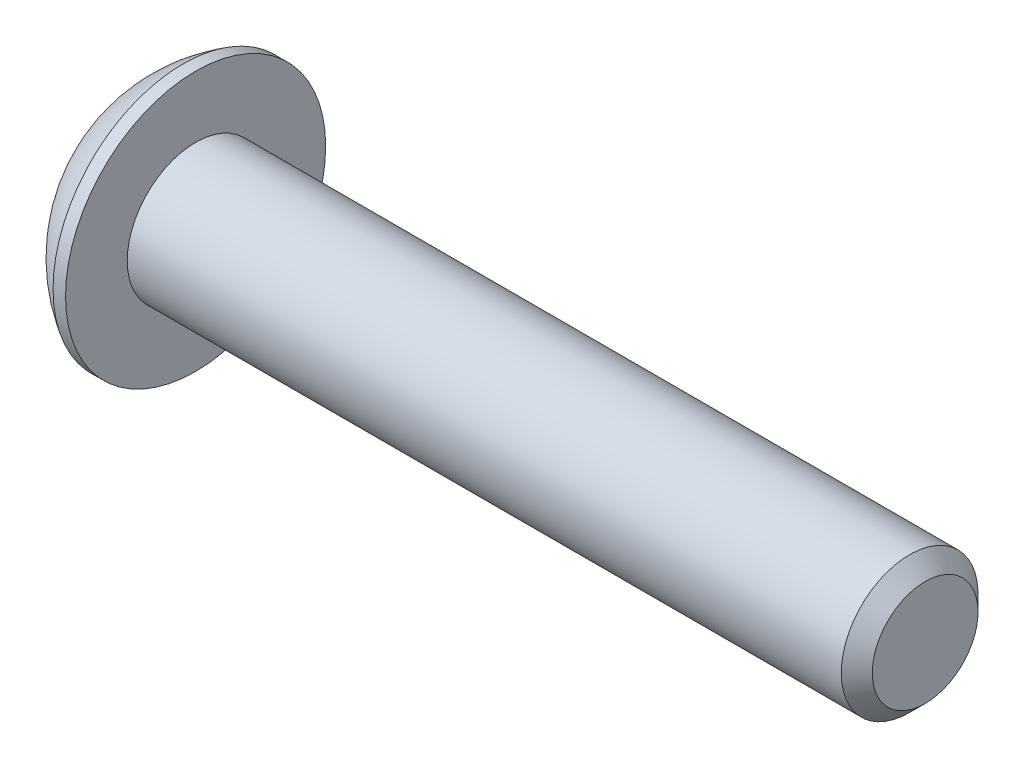
ISO-10303-21;
HEADER;
FILE_DESCRIPTION(('STEP AP214'),'2;1');
FILE_NAME('part.step','',(''),(''),'','','');
FILE_SCHEMA(('AUTOMOTIVE_DESIGN { 1 0 10303 214 1 1 1 1 }'));
ENDSEC;
DATA;
#1=APPLICATION_CONTEXT('core data for automotive mechanical design processes');
#2=APPLICATION_PROTOCOL_DEFINITION('international standard','automotive_design',2000,#1);
#3=PRODUCT_CONTEXT('',#1,'mechanical');
#4=PRODUCT('Part','Part','',(#3));
#5=PRODUCT_RELATED_PRODUCT_CATEGORY('part','',(#4));
#6=PRODUCT_DEFINITION_FORMATION('','',#4);
#7=PRODUCT_DEFINITION_CONTEXT('part definition',#1,'design');
#8=PRODUCT_DEFINITION('design','',#6,#7);
#9=PRODUCT_DEFINITION_SHAPE('','',#8);
#10=(LENGTH_UNIT() NAMED_UNIT(*) SI_UNIT(.MILLI.,.METRE.));
#11=(NAMED_UNIT(*) PLANE_ANGLE_UNIT() SI_UNIT($,.RADIAN.));
#12=(NAMED_UNIT(*) SI_UNIT($,.STERADIAN.) SOLID_ANGLE_UNIT());
#13=UNCERTAINTY_MEASURE_WITH_UNIT(LENGTH_MEASURE(1.E-05),#10,'distance_accuracy_value','');
#14=(GEOMETRIC_REPRESENTATION_CONTEXT(3) GLOBAL_UNCERTAINTY_ASSIGNED_CONTEXT((#13)) GLOBAL_UNIT_ASSIGNED_CONTEXT((#10,
#11,#12)) REPRESENTATION_CONTEXT('',''));
#15=CARTESIAN_POINT('',(0.,0.,0.));
#16=DIRECTION('',(0.,0.,1.));
#17=DIRECTION('',(1.,0.,0.));
#18=AXIS2_PLACEMENT_3D('',#15,#16,#17);
#19=CARTESIAN_POINT('',(1.32080000000034,0.,0.));
#20=DIRECTION('',(-1.,0.,0.));
#21=DIRECTION('',(0.,0.,1.));
#22=AXIS2_PLACEMENT_3D('',#19,#20,#21);
#23=CONICAL_SURFACE('',#22,1.1937999999998,1.04719755119608);
#24=CARTESIAN_POINT('',(2.01004075135902,0.,4.44089209850063E-13));
#25=VERTEX_POINT('',#24);
#26=VERTEX_LOOP('',#25);
#27=FACE_BOUND('',#26,.T.);
#28=CARTESIAN_POINT('',(1.32080000000009,0.,0.));
#29=DIRECTION('',(-1.,0.,0.));
#30=DIRECTION('',(0.,0.,1.));
#31=AXIS2_PLACEMENT_3D('',#28,#29,#30);
#32=CIRCLE('',#31,1.19380000000024);
#33=CARTESIAN_POINT('',(1.32080000000004,-1.03386112703797,0.59690000000006));
#34=VERTEX_POINT('',#33);
#35=CARTESIAN_POINT('',(1.32080000000004,0.,1.19380000000012));
#36=VERTEX_POINT('',#35);
#37=EDGE_CURVE('E19',#34,#36,#32,.T.);
#38=ORIENTED_EDGE('',*,*,#37,.T.);
#39=CARTESIAN_POINT('',(1.32080000000009,0.,0.));
#40=DIRECTION('',(-1.,0.,0.));
#41=DIRECTION('',(0.,0.,1.));
#42=AXIS2_PLACEMENT_3D('',#39,#40,#41);
#43=CIRCLE('',#42,1.19380000000024);
#44=CARTESIAN_POINT('',(1.32080000000004,1.03386112703797,0.596900000000061));
#45=VERTEX_POINT('',#44);
#46=EDGE_CURVE('E148',#36,#45,#43,.T.);
#47=ORIENTED_EDGE('',*,*,#46,.T.);
#48=CARTESIAN_POINT('',(1.32080000000009,0.,0.));
#49=DIRECTION('',(-1.,0.,0.));
#50=DIRECTION('',(0.,0.,1.));
#51=AXIS2_PLACEMENT_3D('',#48,#49,#50);
#52=CIRCLE('',#51,1.19380000000024);
#53=CARTESIAN_POINT('',(1.32080000000004,1.03386112703797,-0.596900000000061));
#54=VERTEX_POINT('',#53);
#55=EDGE_CURVE('E318',#45,#54,#52,.T.);
#56=ORIENTED_EDGE('',*,*,#55,.T.);
#57=CARTESIAN_POINT('',(1.32080000000009,0.,0.));
#58=DIRECTION('',(-1.,0.,0.));
#59=DIRECTION('',(0.,0.,1.));
#60=AXIS2_PLACEMENT_3D('',#57,#58,#59);
#61=CIRCLE('',#60,1.19380000000024);
#62=CARTESIAN_POINT('',(1.32080000000004,1.49457637585666E-12,-1.19380000000012));
#63=VERTEX_POINT('',#62);
#64=EDGE_CURVE('E319',#54,#63,#61,.T.);
#65=ORIENTED_EDGE('',*,*,#64,.T.);
#66=CARTESIAN_POINT('',(1.32080000000009,0.,0.));
#67=DIRECTION('',(-1.,0.,0.));
#68=DIRECTION('',(0.,0.,1.));
#69=AXIS2_PLACEMENT_3D('',#66,#67,#68);
#70=CIRCLE('',#69,1.19380000000024);
#71=CARTESIAN_POINT('',(1.32080000000004,-1.03386112703797,-0.59690000000006));
#72=VERTEX_POINT('',#71);
#73=EDGE_CURVE('E92',#63,#72,#70,.T.);
#74=ORIENTED_EDGE('',*,*,#73,.T.);
#75=CARTESIAN_POINT('',(1.32080000000009,0.,0.));
#76=DIRECTION('',(-1.,0.,0.));
#77=DIRECTION('',(0.,0.,1.));
#78=AXIS2_PLACEMENT_3D('',#75,#76,#77);
#79=CIRCLE('',#78,1.19380000000024);
#80=EDGE_CURVE('E88',#72,#34,#79,.T.);
#81=ORIENTED_EDGE('',*,*,#80,.T.);
#82=EDGE_LOOP('',(#38,#47,#56,#65,#74,#81));
#83=FACE_BOUND('',#82,.T.);
#84=ADVANCED_FACE('F16',(#27,#83),#23,.F.);
#85=CARTESIAN_POINT('',(1.3208,-2.06772225407572,-1.1938));
#86=DIRECTION('',(1.,0.,0.));
#87=DIRECTION('',(0.,0.,-1.));
#88=AXIS2_PLACEMENT_3D('',#85,#86,#87);
#89=PLANE('',#88);
#90=DIRECTION('',(0.,0.5,0.866025403784439));
#91=VECTOR('',#90,1.);
#92=CARTESIAN_POINT('',(1.3208,-1.37848150271715,0.));
#93=LINE('',#92,#91);
#94=CARTESIAN_POINT('',(1.3208,-0.689240751358574,1.1938));
#95=VERTEX_POINT('',#94);
#96=EDGE_CURVE('E100',#95,#34,#93,.F.);
#97=ORIENTED_EDGE('',*,*,#96,.F.);
#98=DIRECTION('',(0.,1.,0.));
#99=VECTOR('',#98,1.);
#100=CARTESIAN_POINT('',(1.3208,-0.689240751358574,1.1938));
#101=LINE('',#100,#99);
#102=EDGE_CURVE('E102',#36,#95,#101,.F.);
#103=ORIENTED_EDGE('',*,*,#102,.F.);
#104=ORIENTED_EDGE('',*,*,#37,.F.);
#105=EDGE_LOOP('',(#97,#103,#104));
#106=FACE_BOUND('',#105,.T.);
#107=ADVANCED_FACE('F98',(#106),#89,.F.);
#108=CARTESIAN_POINT('',(1.3208,-2.06772225407572,-1.1938));
#109=DIRECTION('',(1.,0.,0.));
#110=DIRECTION('',(0.,0.,-1.));
#111=AXIS2_PLACEMENT_3D('',#108,#109,#110);
#112=PLANE('',#111);
#113=DIRECTION('',(0.,-0.5,0.866025403784439));
#114=VECTOR('',#113,1.);
#115=CARTESIAN_POINT('',(1.3208,-0.689240751358574,-1.1938));
#116=LINE('',#115,#114);
#117=CARTESIAN_POINT('',(1.3208,-1.37848150271715,0.));
#118=VERTEX_POINT('',#117);
#119=EDGE_CURVE('E108',#118,#72,#116,.F.);
#120=ORIENTED_EDGE('',*,*,#119,.F.);
#121=DIRECTION('',(0.,0.5,0.866025403784439));
#122=VECTOR('',#121,1.);
#123=CARTESIAN_POINT('',(1.3208,-1.37848150271715,0.));
#124=LINE('',#123,#122);
#125=EDGE_CURVE('E105',#34,#118,#124,.F.);
#126=ORIENTED_EDGE('',*,*,#125,.F.);
#127=ORIENTED_EDGE('',*,*,#80,.F.);
#128=EDGE_LOOP('',(#120,#126,#127));
#129=FACE_BOUND('',#128,.T.);
#130=ADVANCED_FACE('F106',(#129),#112,.F.);
#131=CARTESIAN_POINT('',(1.3208,-2.06772225407572,-1.1938));
#132=DIRECTION('',(1.,0.,0.));
#133=DIRECTION('',(0.,0.,-1.));
#134=AXIS2_PLACEMENT_3D('',#131,#132,#133);
#135=PLANE('',#134);
#136=DIRECTION('',(0.,1.,0.));
#137=VECTOR('',#136,1.);
#138=CARTESIAN_POINT('',(1.3208,0.689240751358577,-1.1938));
#139=LINE('',#138,#137);
#140=CARTESIAN_POINT('',(1.3208,-0.689240751358574,-1.1938));
#141=VERTEX_POINT('',#140);
#142=EDGE_CURVE('E288',#141,#63,#139,.T.);
#143=ORIENTED_EDGE('',*,*,#142,.F.);
#144=DIRECTION('',(0.,-0.5,0.866025403784439));
#145=VECTOR('',#144,1.);
#146=CARTESIAN_POINT('',(1.3208,-0.689240751358574,-1.1938));
#147=LINE('',#146,#145);
#148=EDGE_CURVE('E300',#72,#141,#147,.F.);
#149=ORIENTED_EDGE('',*,*,#148,.F.);
#150=ORIENTED_EDGE('',*,*,#73,.F.);
#151=EDGE_LOOP('',(#143,#149,#150));
#152=FACE_BOUND('',#151,.T.);
#153=ADVANCED_FACE('F191',(#152),#135,.F.);
#154=CARTESIAN_POINT('',(1.3208,-2.06772225407572,-1.1938));
#155=DIRECTION('',(1.,0.,0.));
#156=DIRECTION('',(0.,0.,-1.));
#157=AXIS2_PLACEMENT_3D('',#154,#155,#156);
#158=PLANE('',#157);
#159=DIRECTION('',(0.,-0.5,-0.866025403784439));
#160=VECTOR('',#159,1.);
#161=CARTESIAN_POINT('',(1.3208,1.37848150271715,0.));
#162=LINE('',#161,#160);
#163=CARTESIAN_POINT('',(1.3208,0.689240751358577,-1.1938));
#164=VERTEX_POINT('',#163);
#165=EDGE_CURVE('E274',#164,#54,#162,.F.);
#166=ORIENTED_EDGE('',*,*,#165,.F.);
#167=DIRECTION('',(0.,1.,0.));
#168=VECTOR('',#167,1.);
#169=CARTESIAN_POINT('',(1.3208,0.689240751358577,-1.1938));
#170=LINE('',#169,#168);
#171=EDGE_CURVE('E285',#63,#164,#170,.T.);
#172=ORIENTED_EDGE('',*,*,#171,.F.);
#173=ORIENTED_EDGE('',*,*,#64,.F.);
#174=EDGE_LOOP('',(#166,#172,#173));
#175=FACE_BOUND('',#174,.T.);
#176=ADVANCED_FACE('F187',(#175),#158,.F.);
#177=CARTESIAN_POINT('',(1.3208,-2.06772225407572,-1.1938));
#178=DIRECTION('',(1.,0.,0.));
#179=DIRECTION('',(0.,0.,-1.));
#180=AXIS2_PLACEMENT_3D('',#177,#178,#179);
#181=PLANE('',#180);
#182=DIRECTION('',(0.,0.5,-0.866025403784439));
#183=VECTOR('',#182,1.);
#184=CARTESIAN_POINT('',(1.3208,0.689240751358576,1.1938));
#185=LINE('',#184,#183);
#186=CARTESIAN_POINT('',(1.3208,1.37848150271715,0.));
#187=VERTEX_POINT('',#186);
#188=EDGE_CURVE('E253',#187,#45,#185,.F.);
#189=ORIENTED_EDGE('',*,*,#188,.F.);
#190=DIRECTION('',(0.,-0.5,-0.866025403784439));
#191=VECTOR('',#190,1.);
#192=CARTESIAN_POINT('',(1.3208,1.37848150271715,0.));
#193=LINE('',#192,#191);
#194=EDGE_CURVE('E272',#54,#187,#193,.F.);
#195=ORIENTED_EDGE('',*,*,#194,.F.);
#196=ORIENTED_EDGE('',*,*,#55,.F.);
#197=EDGE_LOOP('',(#189,#195,#196));
#198=FACE_BOUND('',#197,.T.);
#199=ADVANCED_FACE('F183',(#198),#181,.F.);
#200=CARTESIAN_POINT('',(1.3208,-2.06772225407572,-1.1938));
#201=DIRECTION('',(1.,0.,0.));
#202=DIRECTION('',(0.,0.,-1.));
#203=AXIS2_PLACEMENT_3D('',#200,#201,#202);
#204=PLANE('',#203);
#205=DIRECTION('',(0.,1.,0.));
#206=VECTOR('',#205,1.);
#207=CARTESIAN_POINT('',(1.3208,-0.689240751358574,1.1938));
#208=LINE('',#207,#206);
#209=CARTESIAN_POINT('',(1.3208,0.689240751358576,1.1938));
#210=VERTEX_POINT('',#209);
#211=EDGE_CURVE('E117',#210,#36,#208,.F.);
#212=ORIENTED_EDGE('',*,*,#211,.F.);
#213=DIRECTION('',(0.,0.5,-0.866025403784439));
#214=VECTOR('',#213,1.);
#215=CARTESIAN_POINT('',(1.3208,0.689240751358576,1.1938));
#216=LINE('',#215,#214);
#217=EDGE_CURVE('E256',#45,#210,#216,.F.);
#218=ORIENTED_EDGE('',*,*,#217,.F.);
#219=ORIENTED_EDGE('',*,*,#46,.F.);
#220=EDGE_LOOP('',(#212,#218,#219));
#221=FACE_BOUND('',#220,.T.);
#222=ADVANCED_FACE('F179',(#221),#204,.F.);
#223=CARTESIAN_POINT('',(1.3208,-0.689240751358574,1.1938));
#224=DIRECTION('',(0.,0.,-1.));
#225=DIRECTION('',(0.,1.,0.));
#226=AXIS2_PLACEMENT_3D('',#223,#224,#225);
#227=PLANE('',#226);
#228=DIRECTION('',(0.,1.,0.));
#229=VECTOR('',#228,1.);
#230=CARTESIAN_POINT('',(0.,0.,1.1938));
#231=LINE('',#230,#229);
#232=CARTESIAN_POINT('',(0.,0.689240751358577,1.1938));
#233=VERTEX_POINT('',#232);
#234=CARTESIAN_POINT('',(0.,-0.689240751358574,1.1938));
#235=VERTEX_POINT('',#234);
#236=EDGE_CURVE('E250',#233,#235,#231,.F.);
#237=ORIENTED_EDGE('',*,*,#236,.F.);
#238=DIRECTION('',(1.,0.,0.));
#239=VECTOR('',#238,1.);
#240=CARTESIAN_POINT('',(1.3208,0.689240751358576,1.1938));
#241=LINE('',#240,#239);
#242=EDGE_CURVE('E262',#210,#233,#241,.F.);
#243=ORIENTED_EDGE('',*,*,#242,.F.);
#244=ORIENTED_EDGE('',*,*,#211,.T.);
#245=ORIENTED_EDGE('',*,*,#102,.T.);
#246=DIRECTION('',(1.,0.,0.));
#247=VECTOR('',#246,1.);
#248=CARTESIAN_POINT('',(1.3208,-0.689240751358574,1.1938));
#249=LINE('',#248,#247);
#250=EDGE_CURVE('E111',#235,#95,#249,.T.);
#251=ORIENTED_EDGE('',*,*,#250,.F.);
#252=EDGE_LOOP('',(#237,#243,#244,#245,#251));
#253=FACE_BOUND('',#252,.T.);
#254=ADVANCED_FACE('F176',(#253),#227,.T.);
#255=CARTESIAN_POINT('',(1.3208,-1.37848150271715,0.));
#256=DIRECTION('',(0.,0.866025403784439,-0.5));
#257=DIRECTION('',(0.,0.5,0.866025403784439));
#258=AXIS2_PLACEMENT_3D('',#255,#256,#257);
#259=PLANE('',#258);
#260=DIRECTION('',(0.,-0.5,-0.866025403784439));
#261=VECTOR('',#260,1.);
#262=CARTESIAN_POINT('',(0.,-0.689240751358574,1.1938));
#263=LINE('',#262,#261);
#264=CARTESIAN_POINT('',(0.,-1.37848150271715,0.));
#265=VERTEX_POINT('',#264);
#266=EDGE_CURVE('E247',#235,#265,#263,.T.);
#267=ORIENTED_EDGE('',*,*,#266,.F.);
#268=ORIENTED_EDGE('',*,*,#250,.T.);
#269=ORIENTED_EDGE('',*,*,#96,.T.);
#270=ORIENTED_EDGE('',*,*,#125,.T.);
#271=DIRECTION('',(1.,0.,0.));
#272=VECTOR('',#271,1.);
#273=CARTESIAN_POINT('',(1.3208,-1.37848150271715,0.));
#274=LINE('',#273,#272);
#275=EDGE_CURVE('E297',#265,#118,#274,.T.);
#276=ORIENTED_EDGE('',*,*,#275,.F.);
#277=EDGE_LOOP('',(#267,#268,#269,#270,#276));
#278=FACE_BOUND('',#277,.T.);
#279=ADVANCED_FACE('F115',(#278),#259,.T.);
#280=CARTESIAN_POINT('',(1.3208,-0.689240751358574,-1.1938));
#281=DIRECTION('',(0.,0.866025403784439,0.5));
#282=DIRECTION('',(0.,-0.5,0.866025403784439));
#283=AXIS2_PLACEMENT_3D('',#280,#281,#282);
#284=PLANE('',#283);
#285=DIRECTION('',(0.,0.5,-0.866025403784439));
#286=VECTOR('',#285,1.);
#287=CARTESIAN_POINT('',(0.,-1.37848150271715,0.));
#288=LINE('',#287,#286);
#289=CARTESIAN_POINT('',(0.,-0.689240751358574,-1.1938));
#290=VERTEX_POINT('',#289);
#291=EDGE_CURVE('E244',#265,#290,#288,.T.);
#292=ORIENTED_EDGE('',*,*,#291,.F.);
#293=ORIENTED_EDGE('',*,*,#275,.T.);
#294=ORIENTED_EDGE('',*,*,#119,.T.);
#295=ORIENTED_EDGE('',*,*,#148,.T.);
#296=DIRECTION('',(1.,0.,0.));
#297=VECTOR('',#296,1.);
#298=CARTESIAN_POINT('',(1.3208,-0.689240751358574,-1.1938));
#299=LINE('',#298,#297);
#300=EDGE_CURVE('E282',#290,#141,#299,.T.);
#301=ORIENTED_EDGE('',*,*,#300,.F.);
#302=EDGE_LOOP('',(#292,#293,#294,#295,#301));
#303=FACE_BOUND('',#302,.T.);
#304=ADVANCED_FACE('F169',(#303),#284,.T.);
#305=CARTESIAN_POINT('',(1.3208,0.689240751358577,-1.1938));
#306=DIRECTION('',(0.,0.,1.));
#307=DIRECTION('',(1.,0.,0.));
#308=AXIS2_PLACEMENT_3D('',#305,#306,#307);
#309=PLANE('',#308);
#310=DIRECTION('',(0.,1.,0.));
#311=VECTOR('',#310,1.);
#312=CARTESIAN_POINT('',(0.,0.,-1.1938));
#313=LINE('',#312,#311);
#314=CARTESIAN_POINT('',(0.,0.689240751358577,-1.1938));
#315=VERTEX_POINT('',#314);
#316=EDGE_CURVE('E241',#290,#315,#313,.T.);
#317=ORIENTED_EDGE('',*,*,#316,.F.);
#318=ORIENTED_EDGE('',*,*,#300,.T.);
#319=ORIENTED_EDGE('',*,*,#142,.T.);
#320=ORIENTED_EDGE('',*,*,#171,.T.);
#321=DIRECTION('',(1.,0.,0.));
#322=VECTOR('',#321,1.);
#323=CARTESIAN_POINT('',(1.3208,0.689240751358577,-1.1938));
#324=LINE('',#323,#322);
#325=EDGE_CURVE('E257',#315,#164,#324,.T.);
#326=ORIENTED_EDGE('',*,*,#325,.F.);
#327=EDGE_LOOP('',(#317,#318,#319,#320,#326));
#328=FACE_BOUND('',#327,.T.);
#329=ADVANCED_FACE('F166',(#328),#309,.T.);
#330=CARTESIAN_POINT('',(1.3208,1.37848150271715,0.));
#331=DIRECTION('',(0.,-0.866025403784439,0.5));
#332=DIRECTION('',(0.,-0.5,-0.866025403784439));
#333=AXIS2_PLACEMENT_3D('',#330,#331,#332);
#334=PLANE('',#333);
#335=DIRECTION('',(0.,0.5,0.866025403784439));
#336=VECTOR('',#335,1.);
#337=CARTESIAN_POINT('',(0.,0.689240751358577,-1.1938));
#338=LINE('',#337,#336);
#339=CARTESIAN_POINT('',(0.,1.37848150271715,0.));
#340=VERTEX_POINT('',#339);
#341=EDGE_CURVE('E238',#315,#340,#338,.T.);
#342=ORIENTED_EDGE('',*,*,#341,.F.);
#343=ORIENTED_EDGE('',*,*,#325,.T.);
#344=ORIENTED_EDGE('',*,*,#165,.T.);
#345=ORIENTED_EDGE('',*,*,#194,.T.);
#346=DIRECTION('',(1.,0.,0.));
#347=VECTOR('',#346,1.);
#348=CARTESIAN_POINT('',(1.3208,1.37848150271715,0.));
#349=LINE('',#348,#347);
#350=EDGE_CURVE('E34',#340,#187,#349,.T.);
#351=ORIENTED_EDGE('',*,*,#350,.F.);
#352=EDGE_LOOP('',(#342,#343,#344,#345,#351));
#353=FACE_BOUND('',#352,.T.);
#354=ADVANCED_FACE('F162',(#353),#334,.T.);
#355=CARTESIAN_POINT('',(1.3208,0.689240751358576,1.1938));
#356=DIRECTION('',(0.,-0.866025403784439,-0.5));
#357=DIRECTION('',(0.,0.5,-0.866025403784439));
#358=AXIS2_PLACEMENT_3D('',#355,#356,#357);
#359=PLANE('',#358);
#360=DIRECTION('',(0.,-0.5,0.866025403784439));
#361=VECTOR('',#360,1.);
#362=CARTESIAN_POINT('',(0.,1.37848150271715,0.));
#363=LINE('',#362,#361);
#364=EDGE_CURVE('E147',#340,#233,#363,.T.);
#365=ORIENTED_EDGE('',*,*,#364,.F.);
#366=ORIENTED_EDGE('',*,*,#350,.T.);
#367=ORIENTED_EDGE('',*,*,#188,.T.);
#368=ORIENTED_EDGE('',*,*,#217,.T.);
#369=ORIENTED_EDGE('',*,*,#242,.T.);
#370=EDGE_LOOP('',(#365,#366,#367,#368,#369));
#371=FACE_BOUND('',#370,.T.);
#372=ADVANCED_FACE('F158',(#371),#359,.T.);
#373=CARTESIAN_POINT('',(0.,0.,0.));
#374=DIRECTION('',(-1.,0.,0.));
#375=DIRECTION('',(0.,0.,1.));
#376=AXIS2_PLACEMENT_3D('',#373,#374,#375);
#377=PLANE('',#376);
#378=ORIENTED_EDGE('',*,*,#341,.T.);
#379=ORIENTED_EDGE('',*,*,#364,.T.);
#380=ORIENTED_EDGE('',*,*,#236,.T.);
#381=ORIENTED_EDGE('',*,*,#266,.T.);
#382=ORIENTED_EDGE('',*,*,#291,.T.);
#383=ORIENTED_EDGE('',*,*,#316,.T.);
#384=EDGE_LOOP('',(#378,#379,#380,#381,#382,#383));
#385=FACE_BOUND('',#384,.T.);
#386=CARTESIAN_POINT('',(0.,1.9812,0.));
#387=CARTESIAN_POINT('',(0.,1.9811996664299,0.0556258831179428));
#388=CARTESIAN_POINT('',(0.,1.97885520380442,0.111261989398606));
#389=CARTESIAN_POINT('',(0.,1.96949260169541,0.222149719830458));
#390=CARTESIAN_POINT('',(0.,1.96247308239605,0.277401225602895));
#391=CARTESIAN_POINT('',(0.,1.94379192841038,0.387209508139747));
#392=CARTESIAN_POINT('',(-1.85325793235264E-13,1.93212292489526,0.441765039546365));
#393=CARTESIAN_POINT('',(1.86344214223505E-13,1.90422331175315,0.549729449347493));
#394=CARTESIAN_POINT('',(6.94543371897454E-13,1.88798900035338,0.603137359208869));
#395=CARTESIAN_POINT('',(1.15501975216981E-12,1.83266214476501,0.760839131321828));
#396=CARTESIAN_POINT('',(0.,1.78690023648845,0.862876433575429));
#397=CARTESIAN_POINT('',(0.,1.67887358150667,1.05780719540872));
#398=CARTESIAN_POINT('',(9.54193214892627E-13,1.6166082074585,1.15070030720801));
#399=CARTESIAN_POINT('',(5.94805591894675E-13,1.51224157140982,1.28116890915697));
#400=CARTESIAN_POINT('',(1.63221293851378E-13,1.4755970394354,1.32320451127026));
#401=CARTESIAN_POINT('',(-1.62196980336157E-13,1.39893832619713,1.40400288695709));
#402=CARTESIAN_POINT('',(0.,1.35892742784698,1.44276877695455));
#403=CARTESIAN_POINT('',(1.14362537325405E-13,1.23416504602197,1.55382272417904));
#404=CARTESIAN_POINT('',(0.,1.14466125559859,1.62089527952111));
#405=CARTESIAN_POINT('',(0.,0.955712144178167,1.7390221808118));
#406=CARTESIAN_POINT('',(0.,0.856267198233564,1.79007713076007));
#407=CARTESIAN_POINT('',(0.,0.650206345910843,1.87477637530954));
#408=CARTESIAN_POINT('',(0.,0.543590516134855,1.90842085586267));
#409=CARTESIAN_POINT('',(0.,0.326226155292018,1.95733039300656));
#410=CARTESIAN_POINT('',(0.,0.21547760215793,1.97259535144288));
#411=CARTESIAN_POINT('',(0.,-0.00701040587544639,1.98431697865418));
#412=CARTESIAN_POINT('',(0.,-0.118749860774734,1.98077364742917));
#413=CARTESIAN_POINT('',(0.,-0.340050178355485,1.95497485623825));
#414=CARTESIAN_POINT('',(0.,-0.449611052668255,1.93271949620218));
#415=CARTESIAN_POINT('',(0.,-0.663431110729174,1.87014138774523));
#416=CARTESIAN_POINT('',(0.,-0.76769023783852,1.82981844635272));
#417=CARTESIAN_POINT('',(0.,-0.968005760719347,1.73219968377096));
#418=CARTESIAN_POINT('',(0.,-1.0640618469811,1.6749032225164));
#419=CARTESIAN_POINT('',(0.,-1.19980276751283,1.57757371205873));
#420=CARTESIAN_POINT('',(0.,-1.24366557129213,1.54322665019466));
#421=CARTESIAN_POINT('',(0.,-1.32838995706696,1.47093063174264));
#422=CARTESIAN_POINT('',(0.,-1.36924860178706,1.43297823102439));
#423=CARTESIAN_POINT('',(0.,-1.48674671849223,1.31419842051173));
#424=CARTESIAN_POINT('',(0.,-1.55842832343237,1.22836221289311));
#425=CARTESIAN_POINT('',(0.,-1.6863396856475,1.04586168272493));
#426=CARTESIAN_POINT('',(0.,-1.7425700302488,0.949197771949774));
#427=CARTESIAN_POINT('',(0.,-1.8141614250401,0.798182600298684));
#428=CARTESIAN_POINT('',(0.,-1.83591780585875,0.746776203847791));
#429=CARTESIAN_POINT('',(0.,-1.87500754181092,0.642341081688636));
#430=CARTESIAN_POINT('',(0.,-1.89234447645404,0.589313708122847));
#431=CARTESIAN_POINT('',(0.,-1.92246053433554,0.482076273028395));
#432=CARTESIAN_POINT('',(0.,-1.93524685475118,0.42786822425751));
#433=CARTESIAN_POINT('',(0.,-1.95620937250494,0.318578151844611));
#434=CARTESIAN_POINT('',(0.,-1.96438692958147,0.263496390912872));
#435=CARTESIAN_POINT('',(0.,-1.97388528284653,0.173607715038558));
#436=CARTESIAN_POINT('',(0.,-1.97662743364426,0.138944718024998));
#437=CARTESIAN_POINT('',(0.,-1.98028489645283,0.0695224782567002));
#438=CARTESIAN_POINT('',(0.,-1.98120020846367,0.0347632355019631));
#439=CARTESIAN_POINT('',(0.,-1.9811996664299,-0.0556258831179437));
#440=CARTESIAN_POINT('',(0.,-1.97885520380442,-0.111261989398607));
#441=CARTESIAN_POINT('',(0.,-1.96949260169541,-0.222149719830459));
#442=CARTESIAN_POINT('',(0.,-1.96247308239605,-0.277401225602897));
#443=CARTESIAN_POINT('',(0.,-1.94379192841039,-0.387209508139749));
#444=CARTESIAN_POINT('',(-1.85269749640691E-13,-1.93212292489526,-0.441765039546367));
#445=CARTESIAN_POINT('',(1.86288125054388E-13,-1.90422331175315,-0.549729449347495));
#446=CARTESIAN_POINT('',(6.94525090263764E-13,-1.88798900035338,-0.603137359208872));
#447=CARTESIAN_POINT('',(1.15505622829081E-12,-1.83266214476501,-0.760839131321831));
#448=CARTESIAN_POINT('',(0.,-1.78690023648845,-0.862876433575431));
#449=CARTESIAN_POINT('',(0.,-1.67887358150667,-1.05780719540872));
#450=CARTESIAN_POINT('',(9.54248812869379E-13,-1.6166082074585,-1.15070030720801));
#451=CARTESIAN_POINT('',(5.94777756479239E-13,-1.51224157140982,-1.28116890915698));
#452=CARTESIAN_POINT('',(1.63138949183833E-13,-1.47559703943539,-1.32320451127027));
#453=CARTESIAN_POINT('',(-1.62114715061273E-13,-1.39893832619713,-1.40400288695709));
#454=CARTESIAN_POINT('',(0.,-1.35892742784699,-1.44276877695455));
#455=CARTESIAN_POINT('',(1.13760489124207E-13,-1.23416504602197,-1.55382272417904));
#456=CARTESIAN_POINT('',(0.,-1.14466125559859,-1.62089527952111));
#457=CARTESIAN_POINT('',(0.,-0.95571214417816,-1.73902218081179));
#458=CARTESIAN_POINT('',(0.,-0.856267198233559,-1.79007713076007));
#459=CARTESIAN_POINT('',(0.,-0.650206345910841,-1.87477637530954));
#460=CARTESIAN_POINT('',(0.,-0.543590516134854,-1.90842085586267));
#461=CARTESIAN_POINT('',(0.,-0.326226155292018,-1.95733039300657));
#462=CARTESIAN_POINT('',(0.,-0.215477602157929,-1.97259535144288));
#463=CARTESIAN_POINT('',(0.,0.0070104058754487,-1.98431697865418));
#464=CARTESIAN_POINT('',(0.,0.118749860774737,-1.98077364742916));
#465=CARTESIAN_POINT('',(0.,0.340050178355489,-1.95497485623824));
#466=CARTESIAN_POINT('',(0.,0.44961105266826,-1.93271949620218));
#467=CARTESIAN_POINT('',(0.,0.663431110729178,-1.87014138774524));
#468=CARTESIAN_POINT('',(0.,0.767690237838524,-1.82981844635272));
#469=CARTESIAN_POINT('',(0.,0.968005760719348,-1.73219968377096));
#470=CARTESIAN_POINT('',(0.,1.0640618469811,-1.67490322251639));
#471=CARTESIAN_POINT('',(0.,1.19980276751283,-1.57757371205873));
#472=CARTESIAN_POINT('',(0.,1.24366557129214,-1.54322665019465));
#473=CARTESIAN_POINT('',(0.,1.32838995706696,-1.47093063174263));
#474=CARTESIAN_POINT('',(0.,1.36924860178706,-1.43297823102439));
#475=CARTESIAN_POINT('',(0.,1.48674671849223,-1.31419842051172));
#476=CARTESIAN_POINT('',(0.,1.55842832343237,-1.22836221289311));
#477=CARTESIAN_POINT('',(0.,1.6863396856475,-1.04586168272492));
#478=CARTESIAN_POINT('',(0.,1.7425700302488,-0.949197771949768));
#479=CARTESIAN_POINT('',(0.,1.8141614250401,-0.798182600298677));
#480=CARTESIAN_POINT('',(0.,1.83591780585875,-0.746776203847785));
#481=CARTESIAN_POINT('',(0.,1.87500754181092,-0.64234108168863));
#482=CARTESIAN_POINT('',(0.,1.89234447645404,-0.589313708122841));
#483=CARTESIAN_POINT('',(0.,1.92246053433555,-0.482076273028389));
#484=CARTESIAN_POINT('',(0.,1.93524685475118,-0.427868224257505));
#485=CARTESIAN_POINT('',(0.,1.95620937250494,-0.318578151844605));
#486=CARTESIAN_POINT('',(0.,1.96438692958147,-0.263496390912866));
#487=CARTESIAN_POINT('',(0.,1.97388528284653,-0.173607715038553));
#488=CARTESIAN_POINT('',(0.,1.97662743364426,-0.138944718024994));
#489=CARTESIAN_POINT('',(0.,1.98028489645283,-0.0695224782566989));
#490=CARTESIAN_POINT('',(0.,1.98120020846367,-0.034763235501963));
#491=CARTESIAN_POINT('',(0.,1.9812,0.));
#492=B_SPLINE_CURVE_WITH_KNOTS('',3,(#386,#387,#388,#389,#390,#391,#392,#393,#394,#395,#396,
#397,#398,#399,#400,#401,#402,#403,#404,#405,#406,#407,#408,#409,#410,#411,#412,#413,#414,#415,
#416,#417,#418,#419,#420,#421,#422,#423,#424,#425,#426,#427,#428,#429,#430,#431,#432,#433,#434,
#435,#436,#437,#438,#439,#440,#441,#442,#443,#444,#445,#446,#447,#448,#449,#450,#451,#452,#453,
#454,#455,#456,#457,#458,#459,#460,#461,#462,#463,#464,#465,#466,#467,#468,#469,#470,#471,#472,
#473,#474,#475,#476,#477,#478,#479,#480,#481,#482,#483,#484,#485,#486,#487,#488,#489,#490,#491),
.UNSPECIFIED.,.T.,.F.,(4,2,2,2,2,2,2,2,2,2,2,2,2,2,2,2,2,2,2,2,2,2,2,2,2,2,2,2,2,2,2,2,2,2,2,2,
2,2,2,2,2,2,2,2,2,2,2,2,2,2,2,2,4),(0.,0.166845646007828,0.333740557374255,0.500901034367693,
0.668197445942386,1.00199278686282,1.33580081809885,1.50292354032982,1.6698851310853,
2.00370118900129,2.33750465770544,2.67130456115909,3.005106247238,3.33890793331696,
3.67270783677065,4.00651130547476,4.34032736339026,4.50728895414554,4.67441167637632,
5.00821970761259,5.34201504853332,5.50931146010827,5.67647193710191,5.84336684846844,
6.0102124944764,6.11448220058334,6.21875190669029,6.38559755269812,6.55249246406454,
6.71965294105798,6.88694935263268,7.22074469355311,7.55455272478915,7.72167544702011,
7.88863703777559,8.22245309569158,8.55625656439573,8.89005646784938,9.2238581539283,
9.55765984000725,9.89145974346094,10.2252632121651,10.5590792700806,10.7260408608358,
10.8931635830666,11.2269716143029,11.5607669552236,11.7280633667986,11.8952238437922,
12.0621187551587,12.2289644011667,12.3332341072736,12.4375038133806),.UNSPECIFIED.);
#493=CARTESIAN_POINT('',(0.,1.9812,0.));
#494=VERTEX_POINT('',#493);
#495=EDGE_CURVE('E139',#494,#494,#492,.T.);
#496=ORIENTED_EDGE('',*,*,#495,.F.);
#497=EDGE_LOOP('',(#496));
#498=FACE_BOUND('',#497,.T.);
#499=ADVANCED_FACE('F154',(#385,#498),#377,.T.);
#500=CARTESIAN_POINT('',(4.13385,0.,0.));
#501=DIRECTION('',(0.,1.,0.));
#502=DIRECTION('',(1.,0.,0.));
#503=AXIS2_PLACEMENT_3D('',#500,#501,#502);
#504=SPHERICAL_SURFACE('',#503,4.58408870578439);
#505=CARTESIAN_POINT('',(1.8288,0.,0.));
#506=DIRECTION('',(-1.,0.,0.));
#507=DIRECTION('',(0.,0.,1.));
#508=AXIS2_PLACEMENT_3D('',#505,#506,#507);
#509=CIRCLE('',#508,3.9624);
#510=CARTESIAN_POINT('',(1.8288,0.,3.9624));
#511=VERTEX_POINT('',#510);
#512=EDGE_CURVE('E136',#511,#511,#509,.F.);
#513=ORIENTED_EDGE('',*,*,#512,.F.);
#514=EDGE_LOOP('',(#513));
#515=FACE_BOUND('',#514,.T.);
#516=ORIENTED_EDGE('',*,*,#495,.T.);
#517=EDGE_LOOP('',(#516));
#518=FACE_BOUND('',#517,.T.);
#519=ADVANCED_FACE('F150',(#515,#518),#504,.T.);
#520=CARTESIAN_POINT('',(24.4348,0.,0.));
#521=DIRECTION('',(-1.,0.,0.));
#522=DIRECTION('',(0.,0.,1.));
#523=AXIS2_PLACEMENT_3D('',#520,#521,#522);
#524=PLANE('',#523);
#525=CARTESIAN_POINT('',(24.4347999999945,0.,0.));
#526=DIRECTION('',(-1.,0.,0.));
#527=DIRECTION('',(0.,-1.,0.));
#528=AXIS2_PLACEMENT_3D('',#525,#526,#527);
#529=CIRCLE('',#528,1.61035999991554);
#530=CARTESIAN_POINT('',(24.4347999999945,-1.61035999991554,0.));
#531=VERTEX_POINT('',#530);
#532=EDGE_CURVE('E133',#531,#531,#529,.T.);
#533=ORIENTED_EDGE('',*,*,#532,.F.);
#534=EDGE_LOOP('',(#533));
#535=FACE_BOUND('',#534,.T.);
#536=ADVANCED_FACE('F222',(#535),#524,.F.);
#537=CARTESIAN_POINT('',(0.,0.,0.));
#538=DIRECTION('',(-1.,0.,0.));
#539=DIRECTION('',(0.,0.,1.));
#540=AXIS2_PLACEMENT_3D('',#537,#538,#539);
#541=CYLINDRICAL_SURFACE('',#540,3.9624);
#542=ORIENTED_EDGE('',*,*,#512,.T.);
#543=EDGE_LOOP('',(#542));
#544=FACE_BOUND('',#543,.T.);
#545=CARTESIAN_POINT('',(2.2098,0.,0.));
#546=DIRECTION('',(-1.,0.,0.));
#547=DIRECTION('',(0.,0.,1.));
#548=AXIS2_PLACEMENT_3D('',#545,#546,#547);
#549=CIRCLE('',#548,3.9624);
#550=CARTESIAN_POINT('',(2.2098,0.,3.9624));
#551=VERTEX_POINT('',#550);
#552=EDGE_CURVE('E130',#551,#551,#549,.T.);
#553=ORIENTED_EDGE('',*,*,#552,.T.);
#554=EDGE_LOOP('',(#553));
#555=FACE_BOUND('',#554,.T.);
#556=ADVANCED_FACE('F219',(#544,#555),#541,.T.);
#557=CARTESIAN_POINT('',(23.9623599998708,0.,0.));
#558=DIRECTION('',(-1.,0.,0.));
#559=DIRECTION('',(0.,-1.,0.));
#560=AXIS2_PLACEMENT_3D('',#557,#558,#559);
#561=CONICAL_SURFACE('',#560,2.08280000003924,0.785398163397448);
#562=ORIENTED_EDGE('',*,*,#532,.T.);
#563=EDGE_LOOP('',(#562));
#564=FACE_BOUND('',#563,.T.);
#565=CARTESIAN_POINT('',(23.96236,0.,0.));
#566=DIRECTION('',(-1.,0.,0.));
#567=DIRECTION('',(0.,0.,1.));
#568=AXIS2_PLACEMENT_3D('',#565,#566,#567);
#569=CIRCLE('',#568,2.0828);
#570=CARTESIAN_POINT('',(23.96236,0.,2.0828));
#571=VERTEX_POINT('',#570);
#572=EDGE_CURVE('E25',#571,#571,#569,.T.);
#573=ORIENTED_EDGE('',*,*,#572,.F.);
#574=EDGE_LOOP('',(#573));
#575=FACE_BOUND('',#574,.T.);
#576=ADVANCED_FACE('F211',(#564,#575),#561,.T.);
#577=CARTESIAN_POINT('',(2.2098,2.0828,0.));
#578=DIRECTION('',(-1.,0.,0.));
#579=DIRECTION('',(0.,0.,1.));
#580=AXIS2_PLACEMENT_3D('',#577,#578,#579);
#581=PLANE('',#580);
#582=CARTESIAN_POINT('',(2.2098,0.,0.));
#583=DIRECTION('',(-1.,0.,0.));
#584=DIRECTION('',(0.,0.,1.));
#585=AXIS2_PLACEMENT_3D('',#582,#583,#584);
#586=CIRCLE('',#585,2.0828);
#587=CARTESIAN_POINT('',(2.2098,0.,2.0828));
#588=VERTEX_POINT('',#587);
#589=EDGE_CURVE('E11',#588,#588,#586,.F.);
#590=ORIENTED_EDGE('',*,*,#589,.F.);
#591=EDGE_LOOP('',(#590));
#592=FACE_BOUND('',#591,.T.);
#593=ORIENTED_EDGE('',*,*,#552,.F.);
#594=EDGE_LOOP('',(#593));
#595=FACE_BOUND('',#594,.T.);
#596=ADVANCED_FACE('F205',(#592,#595),#581,.F.);
#597=CARTESIAN_POINT('',(0.,0.,0.));
#598=DIRECTION('',(-1.,0.,0.));
#599=DIRECTION('',(0.,0.,1.));
#600=AXIS2_PLACEMENT_3D('',#597,#598,#599);
#601=CYLINDRICAL_SURFACE('',#600,2.0828);
#602=ORIENTED_EDGE('',*,*,#572,.T.);
#603=EDGE_LOOP('',(#602));
#604=FACE_BOUND('',#603,.T.);
#605=ORIENTED_EDGE('',*,*,#589,.T.);
#606=EDGE_LOOP('',(#605));
#607=FACE_BOUND('',#606,.T.);
#608=ADVANCED_FACE('F203',(#604,#607),#601,.T.);
#609=CLOSED_SHELL('',(#84,#107,#130,#153,#176,#199,#222,#254,#279,#304,#329,#354,#372,#499,#519,
#536,#556,#576,#596,#608));
#610=MANIFOLD_SOLID_BREP('B1',#609);
#611=ADVANCED_BREP_SHAPE_REPRESENTATION('',(#18,#610),#14);
#612=SHAPE_DEFINITION_REPRESENTATION(#9,#611);
ENDSEC;
END-ISO-10303-21;
